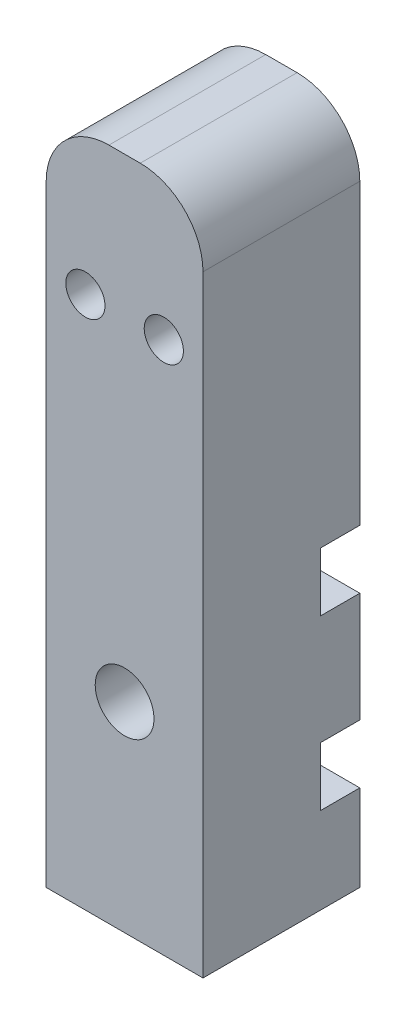
ISO-10303-21;
HEADER;
FILE_DESCRIPTION(('STEP AP214'),'2;1');
FILE_NAME('part.step','',(''),(''),'','','');
FILE_SCHEMA(('AUTOMOTIVE_DESIGN { 1 0 10303 214 1 1 1 1 }'));
ENDSEC;
DATA;
#1=APPLICATION_CONTEXT('core data for automotive mechanical design processes');
#2=APPLICATION_PROTOCOL_DEFINITION('international standard','automotive_design',2000,#1);
#3=PRODUCT_CONTEXT('',#1,'mechanical');
#4=PRODUCT('Part','Part','',(#3));
#5=PRODUCT_RELATED_PRODUCT_CATEGORY('part','',(#4));
#6=PRODUCT_DEFINITION_FORMATION('','',#4);
#7=PRODUCT_DEFINITION_CONTEXT('part definition',#1,'design');
#8=PRODUCT_DEFINITION('design','',#6,#7);
#9=PRODUCT_DEFINITION_SHAPE('','',#8);
#10=(LENGTH_UNIT() NAMED_UNIT(*) SI_UNIT(.MILLI.,.METRE.));
#11=(NAMED_UNIT(*) PLANE_ANGLE_UNIT() SI_UNIT($,.RADIAN.));
#12=(NAMED_UNIT(*) SI_UNIT($,.STERADIAN.) SOLID_ANGLE_UNIT());
#13=UNCERTAINTY_MEASURE_WITH_UNIT(LENGTH_MEASURE(1.E-05),#10,'distance_accuracy_value','');
#14=(GEOMETRIC_REPRESENTATION_CONTEXT(3) GLOBAL_UNCERTAINTY_ASSIGNED_CONTEXT((#13)) GLOBAL_UNIT_ASSIGNED_CONTEXT((#10,
#11,#12)) REPRESENTATION_CONTEXT('',''));
#15=CARTESIAN_POINT('',(0.,0.,0.));
#16=DIRECTION('',(0.,0.,1.));
#17=DIRECTION('',(1.,0.,0.));
#18=AXIS2_PLACEMENT_3D('',#15,#16,#17);
#19=CARTESIAN_POINT('',(0.,0.,-25.4));
#20=DIRECTION('',(0.,0.,1.));
#21=DIRECTION('',(1.,0.,0.));
#22=AXIS2_PLACEMENT_3D('',#19,#20,#21);
#23=PLANE('',#22);
#24=CARTESIAN_POINT('',(0.,-22.225,-25.4));
#25=DIRECTION('',(0.,0.,-1.));
#26=DIRECTION('',(-1.,0.,0.));
#27=AXIS2_PLACEMENT_3D('',#24,#25,#26);
#28=CIRCLE('',#27,4.7625);
#29=CARTESIAN_POINT('',(-4.7625,-22.225,-25.4));
#30=VERTEX_POINT('',#29);
#31=EDGE_CURVE('E212',#30,#30,#28,.T.);
#32=ORIENTED_EDGE('',*,*,#31,.F.);
#33=EDGE_LOOP('',(#32));
#34=FACE_BOUND('',#33,.T.);
#35=DIRECTION('',(0.,-1.,0.));
#36=VECTOR('',#35,1.);
#37=CARTESIAN_POINT('',(-12.7,-54.61,-25.4));
#38=LINE('',#37,#36);
#39=CARTESIAN_POINT('',(-12.7,-13.335,-25.4));
#40=VERTEX_POINT('',#39);
#41=CARTESIAN_POINT('',(-12.7,-31.115,-25.4));
#42=VERTEX_POINT('',#41);
#43=EDGE_CURVE('E253',#40,#42,#38,.T.);
#44=ORIENTED_EDGE('',*,*,#43,.F.);
#45=DIRECTION('',(-1.,0.,0.));
#46=VECTOR('',#45,1.);
#47=CARTESIAN_POINT('',(-12.7,-13.335,-25.4));
#48=LINE('',#47,#46);
#49=CARTESIAN_POINT('',(12.7,-13.335,-25.4));
#50=VERTEX_POINT('',#49);
#51=EDGE_CURVE('E160',#50,#40,#48,.T.);
#52=ORIENTED_EDGE('',*,*,#51,.F.);
#53=DIRECTION('',(0.,1.,0.));
#54=VECTOR('',#53,1.);
#55=CARTESIAN_POINT('',(12.7,-54.61,-25.4));
#56=LINE('',#55,#54);
#57=CARTESIAN_POINT('',(12.7,-31.115,-25.4));
#58=VERTEX_POINT('',#57);
#59=EDGE_CURVE('E264',#58,#50,#56,.T.);
#60=ORIENTED_EDGE('',*,*,#59,.F.);
#61=DIRECTION('',(1.,0.,0.));
#62=VECTOR('',#61,1.);
#63=CARTESIAN_POINT('',(-12.7,-31.115,-25.4));
#64=LINE('',#63,#62);
#65=EDGE_CURVE('E193',#42,#58,#64,.T.);
#66=ORIENTED_EDGE('',*,*,#65,.F.);
#67=EDGE_LOOP('',(#44,#52,#60,#66));
#68=FACE_BOUND('',#67,.T.);
#69=ADVANCED_FACE('F42',(#34,#68),#23,.F.);
#70=CARTESIAN_POINT('',(-12.7,-40.64,-25.4));
#71=VERTEX_POINT('',#70);
#72=CARTESIAN_POINT('',(-12.7,-54.61,-25.4));
#73=VERTEX_POINT('',#72);
#74=EDGE_CURVE('E254',#71,#73,#38,.T.);
#75=ORIENTED_EDGE('',*,*,#74,.F.);
#76=DIRECTION('',(-1.,0.,0.));
#77=VECTOR('',#76,1.);
#78=CARTESIAN_POINT('',(-12.7,-40.64,-25.4));
#79=LINE('',#78,#77);
#80=CARTESIAN_POINT('',(12.7,-40.64,-25.4));
#81=VERTEX_POINT('',#80);
#82=EDGE_CURVE('E190',#81,#71,#79,.T.);
#83=ORIENTED_EDGE('',*,*,#82,.F.);
#84=CARTESIAN_POINT('',(12.7,-54.61,-25.4));
#85=VERTEX_POINT('',#84);
#86=EDGE_CURVE('E259',#85,#81,#56,.T.);
#87=ORIENTED_EDGE('',*,*,#86,.F.);
#88=DIRECTION('',(1.,0.,0.));
#89=VECTOR('',#88,1.);
#90=CARTESIAN_POINT('',(12.7,-54.61,-25.4));
#91=LINE('',#90,#89);
#92=EDGE_CURVE('E252',#73,#85,#91,.T.);
#93=ORIENTED_EDGE('',*,*,#92,.F.);
#94=EDGE_LOOP('',(#75,#83,#87,#93));
#95=FACE_BOUND('',#94,.T.);
#96=ADVANCED_FACE('F338',(#95),#23,.F.);
#97=CARTESIAN_POINT('',(0.,46.736,-25.4));
#98=DIRECTION('',(0.,0.,-1.));
#99=DIRECTION('',(-1.,0.,0.));
#100=AXIS2_PLACEMENT_3D('',#97,#98,#99);
#101=CIRCLE('',#100,4.7625);
#102=CARTESIAN_POINT('',(-4.7625,46.736,-25.4));
#103=VERTEX_POINT('',#102);
#104=EDGE_CURVE('E213',#103,#103,#101,.T.);
#105=ORIENTED_EDGE('',*,*,#104,.F.);
#106=EDGE_LOOP('',(#105));
#107=FACE_BOUND('',#106,.T.);
#108=CARTESIAN_POINT('',(-6.35,31.75,-25.4));
#109=DIRECTION('',(0.,0.,-1.));
#110=DIRECTION('',(-1.,0.,0.));
#111=AXIS2_PLACEMENT_3D('',#108,#109,#110);
#112=CIRCLE('',#111,3.175);
#113=CARTESIAN_POINT('',(-9.525,31.75,-25.4));
#114=VERTEX_POINT('',#113);
#115=EDGE_CURVE('E223',#114,#114,#112,.T.);
#116=ORIENTED_EDGE('',*,*,#115,.F.);
#117=EDGE_LOOP('',(#116));
#118=FACE_BOUND('',#117,.T.);
#119=CARTESIAN_POINT('',(6.34999999999999,31.7499999999999,-25.4));
#120=DIRECTION('',(0.,0.,-1.));
#121=DIRECTION('',(-1.,0.,0.));
#122=AXIS2_PLACEMENT_3D('',#119,#120,#121);
#123=CIRCLE('',#122,3.175);
#124=CARTESIAN_POINT('',(3.175,31.7499999999999,-25.4));
#125=VERTEX_POINT('',#124);
#126=EDGE_CURVE('E222',#125,#125,#123,.F.);
#127=ORIENTED_EDGE('',*,*,#126,.T.);
#128=EDGE_LOOP('',(#127));
#129=FACE_BOUND('',#128,.T.);
#130=CARTESIAN_POINT('',(12.7,-3.81000000000002,-25.4));
#131=VERTEX_POINT('',#130);
#132=CARTESIAN_POINT('',(12.7,44.45,-25.4));
#133=VERTEX_POINT('',#132);
#134=EDGE_CURVE('E258',#131,#133,#56,.T.);
#135=ORIENTED_EDGE('',*,*,#134,.F.);
#136=DIRECTION('',(1.,0.,0.));
#137=VECTOR('',#136,1.);
#138=CARTESIAN_POINT('',(-12.7,-3.81000000000002,-25.4));
#139=LINE('',#138,#137);
#140=CARTESIAN_POINT('',(-12.7,-3.81000000000002,-25.4));
#141=VERTEX_POINT('',#140);
#142=EDGE_CURVE('E197',#141,#131,#139,.T.);
#143=ORIENTED_EDGE('',*,*,#142,.F.);
#144=CARTESIAN_POINT('',(-12.7,44.45,-25.4));
#145=VERTEX_POINT('',#144);
#146=EDGE_CURVE('E165',#145,#141,#38,.T.);
#147=ORIENTED_EDGE('',*,*,#146,.F.);
#148=CARTESIAN_POINT('',(-2.54,44.45,-25.4));
#149=DIRECTION('',(0.,0.,1.));
#150=DIRECTION('',(1.,0.,0.));
#151=AXIS2_PLACEMENT_3D('',#148,#149,#150);
#152=CIRCLE('',#151,10.16);
#153=CARTESIAN_POINT('',(-2.54,54.61,-25.4));
#154=VERTEX_POINT('',#153);
#155=EDGE_CURVE('E306',#145,#154,#152,.F.);
#156=ORIENTED_EDGE('',*,*,#155,.T.);
#157=DIRECTION('',(-1.,0.,0.));
#158=VECTOR('',#157,1.);
#159=CARTESIAN_POINT('',(12.7,54.61,-25.4));
#160=LINE('',#159,#158);
#161=CARTESIAN_POINT('',(2.54,54.61,-25.4));
#162=VERTEX_POINT('',#161);
#163=EDGE_CURVE('E263',#162,#154,#160,.T.);
#164=ORIENTED_EDGE('',*,*,#163,.F.);
#165=CARTESIAN_POINT('',(2.54,44.45,-25.4));
#166=DIRECTION('',(0.,0.,1.));
#167=DIRECTION('',(1.,0.,0.));
#168=AXIS2_PLACEMENT_3D('',#165,#166,#167);
#169=CIRCLE('',#168,10.16);
#170=EDGE_CURVE('E51',#162,#133,#169,.F.);
#171=ORIENTED_EDGE('',*,*,#170,.T.);
#172=EDGE_LOOP('',(#135,#143,#147,#156,#164,#171));
#173=FACE_BOUND('',#172,.T.);
#174=ADVANCED_FACE('F315',(#107,#118,#129,#173),#23,.F.);
#175=CARTESIAN_POINT('',(0.,0.,0.));
#176=DIRECTION('',(0.,0.,1.));
#177=DIRECTION('',(1.,0.,0.));
#178=AXIS2_PLACEMENT_3D('',#175,#176,#177);
#179=PLANE('',#178);
#180=CARTESIAN_POINT('',(6.34999999999999,31.7499999999999,0.));
#181=DIRECTION('',(0.,0.,-1.));
#182=DIRECTION('',(-1.,0.,0.));
#183=AXIS2_PLACEMENT_3D('',#180,#181,#182);
#184=CIRCLE('',#183,3.175);
#185=CARTESIAN_POINT('',(3.175,31.7499999999999,0.));
#186=VERTEX_POINT('',#185);
#187=EDGE_CURVE('E234',#186,#186,#184,.F.);
#188=ORIENTED_EDGE('',*,*,#187,.F.);
#189=EDGE_LOOP('',(#188));
#190=FACE_BOUND('',#189,.T.);
#191=DIRECTION('',(0.,1.,0.));
#192=VECTOR('',#191,1.);
#193=CARTESIAN_POINT('',(12.7,-54.61,0.));
#194=LINE('',#193,#192);
#195=CARTESIAN_POINT('',(12.7,-54.61,0.));
#196=VERTEX_POINT('',#195);
#197=CARTESIAN_POINT('',(12.7,44.45,0.));
#198=VERTEX_POINT('',#197);
#199=EDGE_CURVE('E275',#196,#198,#194,.T.);
#200=ORIENTED_EDGE('',*,*,#199,.T.);
#201=CARTESIAN_POINT('',(2.54,44.45,0.));
#202=DIRECTION('',(0.,0.,1.));
#203=DIRECTION('',(1.,0.,0.));
#204=AXIS2_PLACEMENT_3D('',#201,#202,#203);
#205=CIRCLE('',#204,10.16);
#206=CARTESIAN_POINT('',(2.54,54.61,0.));
#207=VERTEX_POINT('',#206);
#208=EDGE_CURVE('E296',#198,#207,#205,.T.);
#209=ORIENTED_EDGE('',*,*,#208,.T.);
#210=DIRECTION('',(-1.,0.,0.));
#211=VECTOR('',#210,1.);
#212=CARTESIAN_POINT('',(12.7,54.61,0.));
#213=LINE('',#212,#211);
#214=CARTESIAN_POINT('',(-2.54,54.61,0.));
#215=VERTEX_POINT('',#214);
#216=EDGE_CURVE('E279',#207,#215,#213,.T.);
#217=ORIENTED_EDGE('',*,*,#216,.T.);
#218=CARTESIAN_POINT('',(-2.54,44.45,0.));
#219=DIRECTION('',(0.,0.,1.));
#220=DIRECTION('',(1.,0.,0.));
#221=AXIS2_PLACEMENT_3D('',#218,#219,#220);
#222=CIRCLE('',#221,10.16);
#223=CARTESIAN_POINT('',(-12.7,44.45,0.));
#224=VERTEX_POINT('',#223);
#225=EDGE_CURVE('E293',#215,#224,#222,.T.);
#226=ORIENTED_EDGE('',*,*,#225,.T.);
#227=DIRECTION('',(0.,-1.,0.));
#228=VECTOR('',#227,1.);
#229=CARTESIAN_POINT('',(-12.7,-54.61,0.));
#230=LINE('',#229,#228);
#231=CARTESIAN_POINT('',(-12.7,-54.61,0.));
#232=VERTEX_POINT('',#231);
#233=EDGE_CURVE('E246',#224,#232,#230,.T.);
#234=ORIENTED_EDGE('',*,*,#233,.T.);
#235=DIRECTION('',(1.,0.,0.));
#236=VECTOR('',#235,1.);
#237=CARTESIAN_POINT('',(12.7,-54.61,0.));
#238=LINE('',#237,#236);
#239=EDGE_CURVE('E271',#232,#196,#238,.T.);
#240=ORIENTED_EDGE('',*,*,#239,.T.);
#241=EDGE_LOOP('',(#200,#209,#217,#226,#234,#240));
#242=FACE_BOUND('',#241,.T.);
#243=CARTESIAN_POINT('',(-6.35,31.75,0.));
#244=DIRECTION('',(0.,0.,-1.));
#245=DIRECTION('',(-1.,0.,0.));
#246=AXIS2_PLACEMENT_3D('',#243,#244,#245);
#247=CIRCLE('',#246,3.175);
#248=CARTESIAN_POINT('',(-9.525,31.75,0.));
#249=VERTEX_POINT('',#248);
#250=EDGE_CURVE('E218',#249,#249,#247,.T.);
#251=ORIENTED_EDGE('',*,*,#250,.T.);
#252=EDGE_LOOP('',(#251));
#253=FACE_BOUND('',#252,.T.);
#254=CARTESIAN_POINT('',(0.,-22.225,0.));
#255=DIRECTION('',(0.,0.,-1.));
#256=DIRECTION('',(-1.,0.,0.));
#257=AXIS2_PLACEMENT_3D('',#254,#255,#256);
#258=CIRCLE('',#257,4.7625);
#259=CARTESIAN_POINT('',(-4.7625,-22.225,0.));
#260=VERTEX_POINT('',#259);
#261=EDGE_CURVE('E227',#260,#260,#258,.T.);
#262=ORIENTED_EDGE('',*,*,#261,.T.);
#263=EDGE_LOOP('',(#262));
#264=FACE_BOUND('',#263,.T.);
#265=ADVANCED_FACE('F324',(#190,#242,#253,#264),#179,.T.);
#266=CARTESIAN_POINT('',(-12.7,-54.61,-25.4));
#267=DIRECTION('',(-1.,0.,0.));
#268=DIRECTION('',(0.,0.,1.));
#269=AXIS2_PLACEMENT_3D('',#266,#267,#268);
#270=PLANE('',#269);
#271=DIRECTION('',(0.,0.,-1.));
#272=VECTOR('',#271,1.);
#273=CARTESIAN_POINT('',(-12.7,-13.335,-19.05));
#274=LINE('',#273,#272);
#275=CARTESIAN_POINT('',(-12.7,-13.335,-19.05));
#276=VERTEX_POINT('',#275);
#277=EDGE_CURVE('E217',#276,#40,#274,.T.);
#278=ORIENTED_EDGE('',*,*,#277,.T.);
#279=ORIENTED_EDGE('',*,*,#43,.T.);
#280=DIRECTION('',(0.,0.,-1.));
#281=VECTOR('',#280,1.);
#282=CARTESIAN_POINT('',(-12.7,-31.115,-19.05));
#283=LINE('',#282,#281);
#284=CARTESIAN_POINT('',(-12.7,-31.115,-19.05));
#285=VERTEX_POINT('',#284);
#286=EDGE_CURVE('E175',#285,#42,#283,.T.);
#287=ORIENTED_EDGE('',*,*,#286,.F.);
#288=DIRECTION('',(0.,1.,0.));
#289=VECTOR('',#288,1.);
#290=CARTESIAN_POINT('',(-12.7,-40.64,-19.05));
#291=LINE('',#290,#289);
#292=CARTESIAN_POINT('',(-12.7,-40.64,-19.05));
#293=VERTEX_POINT('',#292);
#294=EDGE_CURVE('E194',#293,#285,#291,.T.);
#295=ORIENTED_EDGE('',*,*,#294,.F.);
#296=DIRECTION('',(0.,0.,-1.));
#297=VECTOR('',#296,1.);
#298=CARTESIAN_POINT('',(-12.7,-40.64,-19.05));
#299=LINE('',#298,#297);
#300=EDGE_CURVE('E186',#293,#71,#299,.T.);
#301=ORIENTED_EDGE('',*,*,#300,.T.);
#302=ORIENTED_EDGE('',*,*,#74,.T.);
#303=DIRECTION('',(0.,0.,1.));
#304=VECTOR('',#303,1.);
#305=CARTESIAN_POINT('',(-12.7,-54.61,-25.4));
#306=LINE('',#305,#304);
#307=EDGE_CURVE('E268',#73,#232,#306,.T.);
#308=ORIENTED_EDGE('',*,*,#307,.T.);
#309=ORIENTED_EDGE('',*,*,#233,.F.);
#310=DIRECTION('',(0.,0.,1.));
#311=VECTOR('',#310,1.);
#312=CARTESIAN_POINT('',(-12.7,44.45,-25.4));
#313=LINE('',#312,#311);
#314=EDGE_CURVE('E11',#224,#145,#313,.F.);
#315=ORIENTED_EDGE('',*,*,#314,.T.);
#316=ORIENTED_EDGE('',*,*,#146,.T.);
#317=DIRECTION('',(0.,0.,-1.));
#318=VECTOR('',#317,1.);
#319=CARTESIAN_POINT('',(-12.7,-3.81000000000002,-19.05));
#320=LINE('',#319,#318);
#321=CARTESIAN_POINT('',(-12.7,-3.81000000000002,-19.05));
#322=VERTEX_POINT('',#321);
#323=EDGE_CURVE('E143',#322,#141,#320,.T.);
#324=ORIENTED_EDGE('',*,*,#323,.F.);
#325=DIRECTION('',(0.,1.,0.));
#326=VECTOR('',#325,1.);
#327=CARTESIAN_POINT('',(-12.7,-3.81000000000002,-19.05));
#328=LINE('',#327,#326);
#329=EDGE_CURVE('E150',#276,#322,#328,.T.);
#330=ORIENTED_EDGE('',*,*,#329,.F.);
#331=EDGE_LOOP('',(#278,#279,#287,#295,#301,#302,#308,#309,#315,#316,#324,#330));
#332=FACE_BOUND('',#331,.T.);
#333=ADVANCED_FACE('F163',(#332),#270,.T.);
#334=CARTESIAN_POINT('',(12.7,54.61,-25.4));
#335=DIRECTION('',(0.,1.,0.));
#336=DIRECTION('',(-1.,0.,0.));
#337=AXIS2_PLACEMENT_3D('',#334,#335,#336);
#338=PLANE('',#337);
#339=ORIENTED_EDGE('',*,*,#216,.F.);
#340=DIRECTION('',(0.,0.,1.));
#341=VECTOR('',#340,1.);
#342=CARTESIAN_POINT('',(2.54,54.61,-25.4));
#343=LINE('',#342,#341);
#344=EDGE_CURVE('E303',#207,#162,#343,.F.);
#345=ORIENTED_EDGE('',*,*,#344,.T.);
#346=ORIENTED_EDGE('',*,*,#163,.T.);
#347=DIRECTION('',(0.,0.,1.));
#348=VECTOR('',#347,1.);
#349=CARTESIAN_POINT('',(-2.54,54.61,-25.4));
#350=LINE('',#349,#348);
#351=EDGE_CURVE('E299',#154,#215,#350,.T.);
#352=ORIENTED_EDGE('',*,*,#351,.T.);
#353=EDGE_LOOP('',(#339,#345,#346,#352));
#354=FACE_BOUND('',#353,.T.);
#355=ADVANCED_FACE('F433',(#354),#338,.T.);
#356=CARTESIAN_POINT('',(12.7,-54.61,-25.4));
#357=DIRECTION('',(1.,0.,0.));
#358=DIRECTION('',(0.,0.,-1.));
#359=AXIS2_PLACEMENT_3D('',#356,#357,#358);
#360=PLANE('',#359);
#361=DIRECTION('',(0.,0.,-1.));
#362=VECTOR('',#361,1.);
#363=CARTESIAN_POINT('',(12.7,-13.335,-19.05));
#364=LINE('',#363,#362);
#365=CARTESIAN_POINT('',(12.7,-13.335,-19.05));
#366=VERTEX_POINT('',#365);
#367=EDGE_CURVE('E170',#366,#50,#364,.T.);
#368=ORIENTED_EDGE('',*,*,#367,.F.);
#369=DIRECTION('',(0.,-1.,0.));
#370=VECTOR('',#369,1.);
#371=CARTESIAN_POINT('',(12.7,-3.81000000000002,-19.05));
#372=LINE('',#371,#370);
#373=CARTESIAN_POINT('',(12.7,-3.81000000000002,-19.05));
#374=VERTEX_POINT('',#373);
#375=EDGE_CURVE('E149',#374,#366,#372,.T.);
#376=ORIENTED_EDGE('',*,*,#375,.F.);
#377=DIRECTION('',(0.,0.,-1.));
#378=VECTOR('',#377,1.);
#379=CARTESIAN_POINT('',(12.7,-3.81000000000002,-19.05));
#380=LINE('',#379,#378);
#381=EDGE_CURVE('E146',#374,#131,#380,.T.);
#382=ORIENTED_EDGE('',*,*,#381,.T.);
#383=ORIENTED_EDGE('',*,*,#134,.T.);
#384=DIRECTION('',(0.,0.,1.));
#385=VECTOR('',#384,1.);
#386=CARTESIAN_POINT('',(12.7,44.45,-25.4));
#387=LINE('',#386,#385);
#388=EDGE_CURVE('E286',#133,#198,#387,.T.);
#389=ORIENTED_EDGE('',*,*,#388,.T.);
#390=ORIENTED_EDGE('',*,*,#199,.F.);
#391=DIRECTION('',(0.,0.,1.));
#392=VECTOR('',#391,1.);
#393=CARTESIAN_POINT('',(12.7,-54.61,-25.4));
#394=LINE('',#393,#392);
#395=EDGE_CURVE('E283',#85,#196,#394,.T.);
#396=ORIENTED_EDGE('',*,*,#395,.F.);
#397=ORIENTED_EDGE('',*,*,#86,.T.);
#398=DIRECTION('',(0.,0.,-1.));
#399=VECTOR('',#398,1.);
#400=CARTESIAN_POINT('',(12.7,-40.64,-19.05));
#401=LINE('',#400,#399);
#402=CARTESIAN_POINT('',(12.7,-40.64,-19.05));
#403=VERTEX_POINT('',#402);
#404=EDGE_CURVE('E183',#403,#81,#401,.T.);
#405=ORIENTED_EDGE('',*,*,#404,.F.);
#406=DIRECTION('',(0.,-1.,0.));
#407=VECTOR('',#406,1.);
#408=CARTESIAN_POINT('',(12.7,-40.64,-19.05));
#409=LINE('',#408,#407);
#410=CARTESIAN_POINT('',(12.7,-31.115,-19.05));
#411=VERTEX_POINT('',#410);
#412=EDGE_CURVE('E201',#411,#403,#409,.T.);
#413=ORIENTED_EDGE('',*,*,#412,.F.);
#414=DIRECTION('',(0.,0.,-1.));
#415=VECTOR('',#414,1.);
#416=CARTESIAN_POINT('',(12.7,-31.115,-19.05));
#417=LINE('',#416,#415);
#418=EDGE_CURVE('E179',#411,#58,#417,.T.);
#419=ORIENTED_EDGE('',*,*,#418,.T.);
#420=ORIENTED_EDGE('',*,*,#59,.T.);
#421=EDGE_LOOP('',(#368,#376,#382,#383,#389,#390,#396,#397,#405,#413,#419,#420));
#422=FACE_BOUND('',#421,.T.);
#423=ADVANCED_FACE('F322',(#422),#360,.T.);
#424=CARTESIAN_POINT('',(12.7,-54.61,-25.4));
#425=DIRECTION('',(0.,-1.,0.));
#426=DIRECTION('',(1.,0.,0.));
#427=AXIS2_PLACEMENT_3D('',#424,#425,#426);
#428=PLANE('',#427);
#429=CARTESIAN_POINT('',(0.,-54.61,-12.7));
#430=DIRECTION('',(0.,-1.,0.));
#431=DIRECTION('',(1.,0.,0.));
#432=AXIS2_PLACEMENT_3D('',#429,#430,#431);
#433=CIRCLE('',#432,3.175);
#434=CARTESIAN_POINT('',(3.17500000000001,-54.61,-12.7));
#435=VERTEX_POINT('',#434);
#436=EDGE_CURVE('E238',#435,#435,#433,.T.);
#437=ORIENTED_EDGE('',*,*,#436,.F.);
#438=EDGE_LOOP('',(#437));
#439=FACE_BOUND('',#438,.T.);
#440=ORIENTED_EDGE('',*,*,#239,.F.);
#441=ORIENTED_EDGE('',*,*,#307,.F.);
#442=ORIENTED_EDGE('',*,*,#92,.T.);
#443=ORIENTED_EDGE('',*,*,#395,.T.);
#444=EDGE_LOOP('',(#440,#441,#442,#443));
#445=FACE_BOUND('',#444,.T.);
#446=ADVANCED_FACE('F331',(#439,#445),#428,.T.);
#447=CARTESIAN_POINT('',(2.54,44.45,-25.4));
#448=DIRECTION('',(0.,0.,1.));
#449=DIRECTION('',(1.,0.,0.));
#450=AXIS2_PLACEMENT_3D('',#447,#448,#449);
#451=CYLINDRICAL_SURFACE('',#450,10.16);
#452=ORIENTED_EDGE('',*,*,#170,.F.);
#453=ORIENTED_EDGE('',*,*,#344,.F.);
#454=ORIENTED_EDGE('',*,*,#208,.F.);
#455=ORIENTED_EDGE('',*,*,#388,.F.);
#456=EDGE_LOOP('',(#452,#453,#454,#455));
#457=FACE_BOUND('',#456,.T.);
#458=ADVANCED_FACE('F318',(#457),#451,.T.);
#459=CARTESIAN_POINT('',(-2.54,44.45,-25.4));
#460=DIRECTION('',(0.,0.,1.));
#461=DIRECTION('',(1.,0.,0.));
#462=AXIS2_PLACEMENT_3D('',#459,#460,#461);
#463=CYLINDRICAL_SURFACE('',#462,10.16);
#464=ORIENTED_EDGE('',*,*,#155,.F.);
#465=ORIENTED_EDGE('',*,*,#314,.F.);
#466=ORIENTED_EDGE('',*,*,#225,.F.);
#467=ORIENTED_EDGE('',*,*,#351,.F.);
#468=EDGE_LOOP('',(#464,#465,#466,#467));
#469=FACE_BOUND('',#468,.T.);
#470=ADVANCED_FACE('F44',(#469),#463,.T.);
#471=CARTESIAN_POINT('',(0.,-36.83,-12.7));
#472=DIRECTION('',(0.,-1.,0.));
#473=DIRECTION('',(1.,0.,0.));
#474=AXIS2_PLACEMENT_3D('',#471,#472,#473);
#475=CYLINDRICAL_SURFACE('',#474,3.175);
#476=CARTESIAN_POINT('',(0.,-36.83,-12.7));
#477=DIRECTION('',(0.,-1.,0.));
#478=DIRECTION('',(1.,0.,0.));
#479=AXIS2_PLACEMENT_3D('',#476,#477,#478);
#480=CIRCLE('',#479,3.175);
#481=CARTESIAN_POINT('',(3.17500000000001,-36.83,-12.7));
#482=VERTEX_POINT('',#481);
#483=EDGE_CURVE('E242',#482,#482,#480,.T.);
#484=ORIENTED_EDGE('',*,*,#483,.F.);
#485=EDGE_LOOP('',(#484));
#486=FACE_BOUND('',#485,.T.);
#487=ORIENTED_EDGE('',*,*,#436,.T.);
#488=EDGE_LOOP('',(#487));
#489=FACE_BOUND('',#488,.T.);
#490=ADVANCED_FACE('F413',(#486,#489),#475,.F.);
#491=CARTESIAN_POINT('',(0.,-36.83,-12.7));
#492=DIRECTION('',(0.,-1.,0.));
#493=DIRECTION('',(1.,0.,0.));
#494=AXIS2_PLACEMENT_3D('',#491,#492,#493);
#495=PLANE('',#494);
#496=ORIENTED_EDGE('',*,*,#483,.T.);
#497=EDGE_LOOP('',(#496));
#498=FACE_BOUND('',#497,.T.);
#499=ADVANCED_FACE('F403',(#498),#495,.T.);
#500=CARTESIAN_POINT('',(6.34999999999999,31.7499999999999,0.));
#501=DIRECTION('',(0.,0.,-1.));
#502=DIRECTION('',(-1.,0.,0.));
#503=AXIS2_PLACEMENT_3D('',#500,#501,#502);
#504=CYLINDRICAL_SURFACE('',#503,3.175);
#505=ORIENTED_EDGE('',*,*,#187,.T.);
#506=EDGE_LOOP('',(#505));
#507=FACE_BOUND('',#506,.T.);
#508=ORIENTED_EDGE('',*,*,#126,.F.);
#509=EDGE_LOOP('',(#508));
#510=FACE_BOUND('',#509,.T.);
#511=ADVANCED_FACE('F400',(#507,#510),#504,.F.);
#512=CARTESIAN_POINT('',(-6.35,31.75,0.));
#513=DIRECTION('',(0.,0.,-1.));
#514=DIRECTION('',(-1.,0.,0.));
#515=AXIS2_PLACEMENT_3D('',#512,#513,#514);
#516=CYLINDRICAL_SURFACE('',#515,3.175);
#517=ORIENTED_EDGE('',*,*,#250,.F.);
#518=EDGE_LOOP('',(#517));
#519=FACE_BOUND('',#518,.T.);
#520=ORIENTED_EDGE('',*,*,#115,.T.);
#521=EDGE_LOOP('',(#520));
#522=FACE_BOUND('',#521,.T.);
#523=ADVANCED_FACE('F402',(#519,#522),#516,.F.);
#524=CARTESIAN_POINT('',(0.,-22.225,0.));
#525=DIRECTION('',(0.,0.,-1.));
#526=DIRECTION('',(-1.,0.,0.));
#527=AXIS2_PLACEMENT_3D('',#524,#525,#526);
#528=CYLINDRICAL_SURFACE('',#527,4.7625);
#529=ORIENTED_EDGE('',*,*,#261,.F.);
#530=EDGE_LOOP('',(#529));
#531=FACE_BOUND('',#530,.T.);
#532=ORIENTED_EDGE('',*,*,#31,.T.);
#533=EDGE_LOOP('',(#532));
#534=FACE_BOUND('',#533,.T.);
#535=ADVANCED_FACE('F410',(#531,#534),#528,.F.);
#536=CARTESIAN_POINT('',(0.,46.736,-8.89));
#537=DIRECTION('',(0.,0.,-1.));
#538=DIRECTION('',(-1.,0.,0.));
#539=AXIS2_PLACEMENT_3D('',#536,#537,#538);
#540=CYLINDRICAL_SURFACE('',#539,4.7625);
#541=CARTESIAN_POINT('',(0.,46.736,-8.89));
#542=DIRECTION('',(0.,0.,-1.));
#543=DIRECTION('',(-1.,0.,0.));
#544=AXIS2_PLACEMENT_3D('',#541,#542,#543);
#545=CIRCLE('',#544,4.7625);
#546=CARTESIAN_POINT('',(-4.7625,46.736,-8.89));
#547=VERTEX_POINT('',#546);
#548=EDGE_CURVE('E208',#547,#547,#545,.T.);
#549=ORIENTED_EDGE('',*,*,#548,.F.);
#550=EDGE_LOOP('',(#549));
#551=FACE_BOUND('',#550,.T.);
#552=ORIENTED_EDGE('',*,*,#104,.T.);
#553=EDGE_LOOP('',(#552));
#554=FACE_BOUND('',#553,.T.);
#555=ADVANCED_FACE('F532',(#551,#554),#540,.F.);
#556=CARTESIAN_POINT('',(0.,0.,-8.89));
#557=DIRECTION('',(0.,0.,-1.));
#558=DIRECTION('',(-1.,0.,0.));
#559=AXIS2_PLACEMENT_3D('',#556,#557,#558);
#560=PLANE('',#559);
#561=ORIENTED_EDGE('',*,*,#548,.T.);
#562=EDGE_LOOP('',(#561));
#563=FACE_BOUND('',#562,.T.);
#564=ADVANCED_FACE('F465',(#563),#560,.T.);
#565=CARTESIAN_POINT('',(-12.7,-40.64,-19.05));
#566=DIRECTION('',(0.,-1.,0.));
#567=DIRECTION('',(1.,0.,0.));
#568=AXIS2_PLACEMENT_3D('',#565,#566,#567);
#569=PLANE('',#568);
#570=ORIENTED_EDGE('',*,*,#82,.T.);
#571=ORIENTED_EDGE('',*,*,#300,.F.);
#572=DIRECTION('',(-1.,0.,0.));
#573=VECTOR('',#572,1.);
#574=CARTESIAN_POINT('',(-12.7,-40.64,-19.05));
#575=LINE('',#574,#573);
#576=EDGE_CURVE('E178',#403,#293,#575,.T.);
#577=ORIENTED_EDGE('',*,*,#576,.F.);
#578=ORIENTED_EDGE('',*,*,#404,.T.);
#579=EDGE_LOOP('',(#570,#571,#577,#578));
#580=FACE_BOUND('',#579,.T.);
#581=ADVANCED_FACE('F340',(#580),#569,.F.);
#582=CARTESIAN_POINT('',(-12.7,-31.115,-19.05));
#583=DIRECTION('',(0.,1.,0.));
#584=DIRECTION('',(-1.,0.,0.));
#585=AXIS2_PLACEMENT_3D('',#582,#583,#584);
#586=PLANE('',#585);
#587=ORIENTED_EDGE('',*,*,#65,.T.);
#588=ORIENTED_EDGE('',*,*,#418,.F.);
#589=DIRECTION('',(1.,0.,0.));
#590=VECTOR('',#589,1.);
#591=CARTESIAN_POINT('',(-12.7,-31.115,-19.05));
#592=LINE('',#591,#590);
#593=EDGE_CURVE('E66',#285,#411,#592,.T.);
#594=ORIENTED_EDGE('',*,*,#593,.F.);
#595=ORIENTED_EDGE('',*,*,#286,.T.);
#596=EDGE_LOOP('',(#587,#588,#594,#595));
#597=FACE_BOUND('',#596,.T.);
#598=ADVANCED_FACE('F376',(#597),#586,.F.);
#599=CARTESIAN_POINT('',(0.,0.,-19.05));
#600=DIRECTION('',(0.,0.,-1.));
#601=DIRECTION('',(-1.,0.,0.));
#602=AXIS2_PLACEMENT_3D('',#599,#600,#601);
#603=PLANE('',#602);
#604=ORIENTED_EDGE('',*,*,#294,.T.);
#605=ORIENTED_EDGE('',*,*,#593,.T.);
#606=ORIENTED_EDGE('',*,*,#412,.T.);
#607=ORIENTED_EDGE('',*,*,#576,.T.);
#608=EDGE_LOOP('',(#604,#605,#606,#607));
#609=FACE_BOUND('',#608,.T.);
#610=ADVANCED_FACE('F345',(#609),#603,.T.);
#611=CARTESIAN_POINT('',(-12.7,-13.335,-19.05));
#612=DIRECTION('',(0.,-1.,0.));
#613=DIRECTION('',(1.,0.,0.));
#614=AXIS2_PLACEMENT_3D('',#611,#612,#613);
#615=PLANE('',#614);
#616=ORIENTED_EDGE('',*,*,#51,.T.);
#617=ORIENTED_EDGE('',*,*,#277,.F.);
#618=DIRECTION('',(-1.,0.,0.));
#619=VECTOR('',#618,1.);
#620=CARTESIAN_POINT('',(-12.7,-13.335,-19.05));
#621=LINE('',#620,#619);
#622=EDGE_CURVE('E156',#366,#276,#621,.T.);
#623=ORIENTED_EDGE('',*,*,#622,.F.);
#624=ORIENTED_EDGE('',*,*,#367,.T.);
#625=EDGE_LOOP('',(#616,#617,#623,#624));
#626=FACE_BOUND('',#625,.T.);
#627=ADVANCED_FACE('F368',(#626),#615,.F.);
#628=CARTESIAN_POINT('',(-12.7,-3.81000000000002,-19.05));
#629=DIRECTION('',(0.,1.,0.));
#630=DIRECTION('',(-1.,0.,0.));
#631=AXIS2_PLACEMENT_3D('',#628,#629,#630);
#632=PLANE('',#631);
#633=ORIENTED_EDGE('',*,*,#142,.T.);
#634=ORIENTED_EDGE('',*,*,#381,.F.);
#635=DIRECTION('',(1.,0.,0.));
#636=VECTOR('',#635,1.);
#637=CARTESIAN_POINT('',(-12.7,-3.81000000000002,-19.05));
#638=LINE('',#637,#636);
#639=EDGE_CURVE('E58',#322,#374,#638,.T.);
#640=ORIENTED_EDGE('',*,*,#639,.F.);
#641=ORIENTED_EDGE('',*,*,#323,.T.);
#642=EDGE_LOOP('',(#633,#634,#640,#641));
#643=FACE_BOUND('',#642,.T.);
#644=ADVANCED_FACE('F141',(#643),#632,.F.);
#645=CARTESIAN_POINT('',(0.,0.,-19.05));
#646=DIRECTION('',(0.,0.,1.));
#647=DIRECTION('',(1.,0.,0.));
#648=AXIS2_PLACEMENT_3D('',#645,#646,#647);
#649=PLANE('',#648);
#650=ORIENTED_EDGE('',*,*,#329,.T.);
#651=ORIENTED_EDGE('',*,*,#639,.T.);
#652=ORIENTED_EDGE('',*,*,#375,.T.);
#653=ORIENTED_EDGE('',*,*,#622,.T.);
#654=EDGE_LOOP('',(#650,#651,#652,#653));
#655=FACE_BOUND('',#654,.T.);
#656=ADVANCED_FACE('F154',(#655),#649,.F.);
#657=CLOSED_SHELL('',(#69,#96,#174,#265,#333,#355,#423,#446,#458,#470,#490,#499,#511,#523,#535,
#555,#564,#581,#598,#610,#627,#644,#656));
#658=MANIFOLD_SOLID_BREP('B2',#657);
#659=ADVANCED_BREP_SHAPE_REPRESENTATION('',(#18,#658),#14);
#660=SHAPE_DEFINITION_REPRESENTATION(#9,#659);
ENDSEC;
END-ISO-10303-21;
